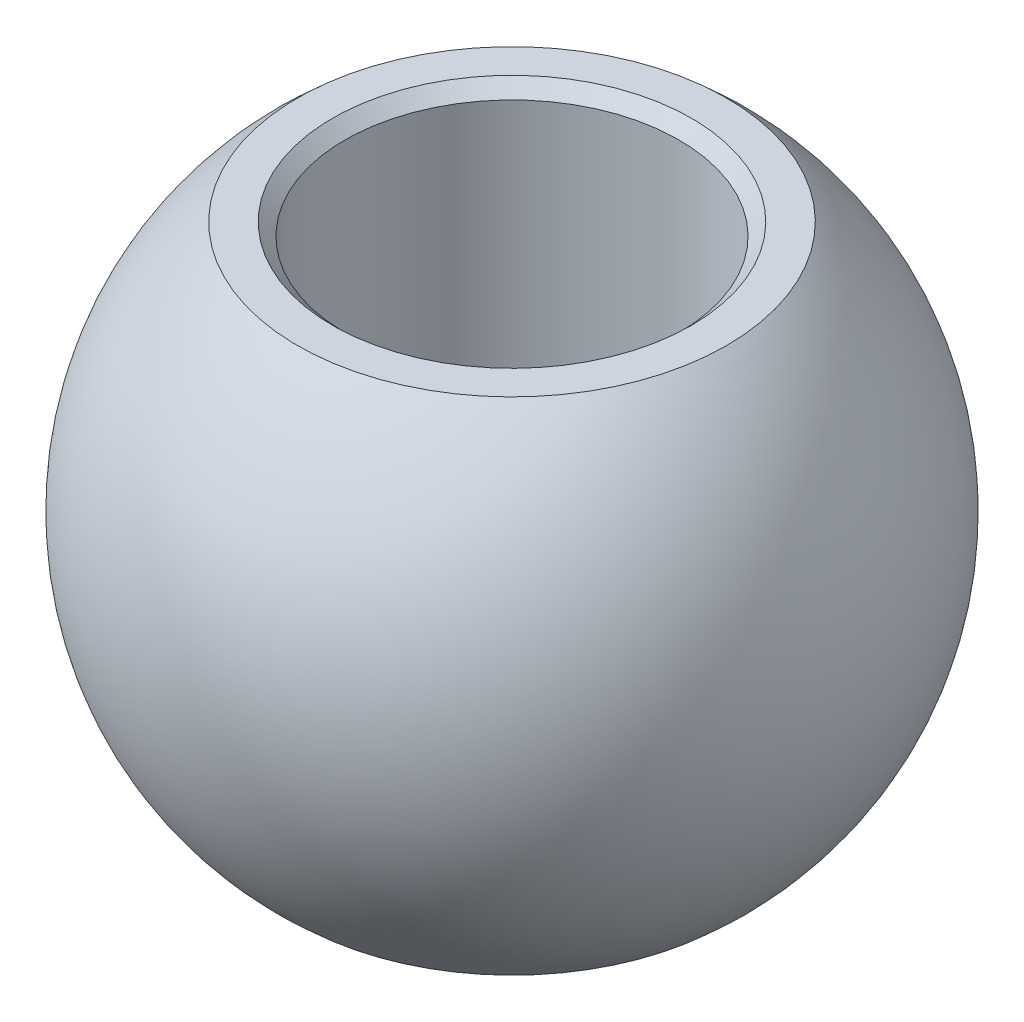
ISO-10303-21;
HEADER;
FILE_DESCRIPTION(('STEP AP214'),'2;1');
FILE_NAME('part.step','',(''),(''),'','','');
FILE_SCHEMA(('AUTOMOTIVE_DESIGN { 1 0 10303 214 1 1 1 1 }'));
ENDSEC;
DATA;
#1=APPLICATION_CONTEXT('core data for automotive mechanical design processes');
#2=APPLICATION_PROTOCOL_DEFINITION('international standard','automotive_design',2000,#1);
#3=PRODUCT_CONTEXT('',#1,'mechanical');
#4=PRODUCT('Part','Part','',(#3));
#5=PRODUCT_RELATED_PRODUCT_CATEGORY('part','',(#4));
#6=PRODUCT_DEFINITION_FORMATION('','',#4);
#7=PRODUCT_DEFINITION_CONTEXT('part definition',#1,'design');
#8=PRODUCT_DEFINITION('design','',#6,#7);
#9=PRODUCT_DEFINITION_SHAPE('','',#8);
#10=(LENGTH_UNIT() NAMED_UNIT(*) SI_UNIT(.MILLI.,.METRE.));
#11=(NAMED_UNIT(*) PLANE_ANGLE_UNIT() SI_UNIT($,.RADIAN.));
#12=(NAMED_UNIT(*) SI_UNIT($,.STERADIAN.) SOLID_ANGLE_UNIT());
#13=UNCERTAINTY_MEASURE_WITH_UNIT(LENGTH_MEASURE(1.E-05),#10,'distance_accuracy_value','');
#14=(GEOMETRIC_REPRESENTATION_CONTEXT(3) GLOBAL_UNCERTAINTY_ASSIGNED_CONTEXT((#13)) GLOBAL_UNIT_ASSIGNED_CONTEXT((#10,
#11,#12)) REPRESENTATION_CONTEXT('',''));
#15=CARTESIAN_POINT('',(0.,0.,0.));
#16=DIRECTION('',(0.,0.,1.));
#17=DIRECTION('',(1.,0.,0.));
#18=AXIS2_PLACEMENT_3D('',#15,#16,#17);
#19=CARTESIAN_POINT('',(0.,0.,0.));
#20=DIRECTION('',(0.,-1.,0.));
#21=DIRECTION('',(-1.,0.,0.));
#22=AXIS2_PLACEMENT_3D('',#19,#20,#21);
#23=SPHERICAL_SURFACE('',#22,7.9);
#24=CARTESIAN_POINT('',(0.,6.,0.));
#25=DIRECTION('',(0.,-1.,0.));
#26=DIRECTION('',(1.,0.,0.));
#27=AXIS2_PLACEMENT_3D('',#24,#25,#26);
#28=CIRCLE('',#27,5.13906606301184);
#29=CARTESIAN_POINT('',(5.13906606301184,6.,0.));
#30=VERTEX_POINT('',#29);
#31=EDGE_CURVE('E62',#30,#30,#28,.T.);
#32=ORIENTED_EDGE('',*,*,#31,.T.);
#33=EDGE_LOOP('',(#32));
#34=FACE_BOUND('',#33,.T.);
#35=CARTESIAN_POINT('',(0.,-6.,0.));
#36=DIRECTION('',(0.,-1.,0.));
#37=DIRECTION('',(1.,0.,0.));
#38=AXIS2_PLACEMENT_3D('',#35,#36,#37);
#39=CIRCLE('',#38,5.13906606301184);
#40=CARTESIAN_POINT('',(5.13906606301184,-6.,0.));
#41=VERTEX_POINT('',#40);
#42=EDGE_CURVE('E59',#41,#41,#39,.T.);
#43=ORIENTED_EDGE('',*,*,#42,.F.);
#44=EDGE_LOOP('',(#43));
#45=FACE_BOUND('',#44,.T.);
#46=ADVANCED_FACE('F38',(#34,#45),#23,.T.);
#47=CARTESIAN_POINT('',(0.,-6.,0.));
#48=DIRECTION('',(0.,-1.,0.));
#49=DIRECTION('',(1.,0.,0.));
#50=AXIS2_PLACEMENT_3D('',#47,#48,#49);
#51=PLANE('',#50);
#52=CARTESIAN_POINT('',(0.,-6.,0.));
#53=DIRECTION('',(0.,-1.,0.));
#54=DIRECTION('',(1.,0.,0.));
#55=AXIS2_PLACEMENT_3D('',#52,#53,#54);
#56=CIRCLE('',#55,4.3);
#57=CARTESIAN_POINT('',(4.3,-6.,0.));
#58=VERTEX_POINT('',#57);
#59=EDGE_CURVE('E46',#58,#58,#56,.F.);
#60=ORIENTED_EDGE('',*,*,#59,.T.);
#61=EDGE_LOOP('',(#60));
#62=FACE_BOUND('',#61,.T.);
#63=ORIENTED_EDGE('',*,*,#42,.T.);
#64=EDGE_LOOP('',(#63));
#65=FACE_BOUND('',#64,.T.);
#66=ADVANCED_FACE('F78',(#62,#65),#51,.T.);
#67=CARTESIAN_POINT('',(0.,-6.,0.));
#68=DIRECTION('',(0.,-1.,0.));
#69=DIRECTION('',(1.,0.,0.));
#70=AXIS2_PLACEMENT_3D('',#67,#68,#69);
#71=CYLINDRICAL_SURFACE('',#70,4.);
#72=CARTESIAN_POINT('',(0.,-5.7,0.));
#73=DIRECTION('',(0.,-1.,0.));
#74=DIRECTION('',(1.,0.,0.));
#75=AXIS2_PLACEMENT_3D('',#72,#73,#74);
#76=CIRCLE('',#75,4.);
#77=CARTESIAN_POINT('',(4.,-5.7,0.));
#78=VERTEX_POINT('',#77);
#79=EDGE_CURVE('E50',#78,#78,#76,.T.);
#80=ORIENTED_EDGE('',*,*,#79,.T.);
#81=EDGE_LOOP('',(#80));
#82=FACE_BOUND('',#81,.T.);
#83=CARTESIAN_POINT('',(0.,5.7,0.));
#84=DIRECTION('',(0.,-1.,0.));
#85=DIRECTION('',(1.,0.,0.));
#86=AXIS2_PLACEMENT_3D('',#83,#84,#85);
#87=CIRCLE('',#86,4.);
#88=CARTESIAN_POINT('',(4.,5.7,0.));
#89=VERTEX_POINT('',#88);
#90=EDGE_CURVE('E54',#89,#89,#87,.F.);
#91=ORIENTED_EDGE('',*,*,#90,.T.);
#92=EDGE_LOOP('',(#91));
#93=FACE_BOUND('',#92,.T.);
#94=ADVANCED_FACE('F71',(#82,#93),#71,.F.);
#95=CARTESIAN_POINT('',(0.,6.,0.));
#96=DIRECTION('',(0.,-1.,0.));
#97=DIRECTION('',(1.,0.,0.));
#98=AXIS2_PLACEMENT_3D('',#95,#96,#97);
#99=PLANE('',#98);
#100=CARTESIAN_POINT('',(0.,6.,0.));
#101=DIRECTION('',(0.,-1.,0.));
#102=DIRECTION('',(1.,0.,0.));
#103=AXIS2_PLACEMENT_3D('',#100,#101,#102);
#104=CIRCLE('',#103,4.3);
#105=CARTESIAN_POINT('',(4.3,6.,0.));
#106=VERTEX_POINT('',#105);
#107=EDGE_CURVE('E10',#106,#106,#104,.T.);
#108=ORIENTED_EDGE('',*,*,#107,.T.);
#109=EDGE_LOOP('',(#108));
#110=FACE_BOUND('',#109,.T.);
#111=ORIENTED_EDGE('',*,*,#31,.F.);
#112=EDGE_LOOP('',(#111));
#113=FACE_BOUND('',#112,.T.);
#114=ADVANCED_FACE('F68',(#110,#113),#99,.F.);
#115=CARTESIAN_POINT('',(0.,-5.7,0.));
#116=DIRECTION('',(0.,-1.,0.));
#117=DIRECTION('',(1.,0.,0.));
#118=AXIS2_PLACEMENT_3D('',#115,#116,#117);
#119=CONICAL_SURFACE('',#118,4.,0.78539816339745);
#120=ORIENTED_EDGE('',*,*,#59,.F.);
#121=EDGE_LOOP('',(#120));
#122=FACE_BOUND('',#121,.T.);
#123=ORIENTED_EDGE('',*,*,#79,.F.);
#124=EDGE_LOOP('',(#123));
#125=FACE_BOUND('',#124,.T.);
#126=ADVANCED_FACE('F70',(#122,#125),#119,.F.);
#127=CARTESIAN_POINT('',(0.,6.,0.));
#128=DIRECTION('',(0.,1.,0.));
#129=DIRECTION('',(-1.,0.,0.));
#130=AXIS2_PLACEMENT_3D('',#127,#128,#129);
#131=CONICAL_SURFACE('',#130,4.3,0.785398163397448);
#132=ORIENTED_EDGE('',*,*,#90,.F.);
#133=EDGE_LOOP('',(#132));
#134=FACE_BOUND('',#133,.T.);
#135=ORIENTED_EDGE('',*,*,#107,.F.);
#136=EDGE_LOOP('',(#135));
#137=FACE_BOUND('',#136,.T.);
#138=ADVANCED_FACE('F41',(#134,#137),#131,.F.);
#139=CLOSED_SHELL('',(#46,#66,#94,#114,#126,#138));
#140=MANIFOLD_SOLID_BREP('B2',#139);
#141=ADVANCED_BREP_SHAPE_REPRESENTATION('',(#18,#140),#14);
#142=SHAPE_DEFINITION_REPRESENTATION(#9,#141);
ENDSEC;
END-ISO-10303-21;
